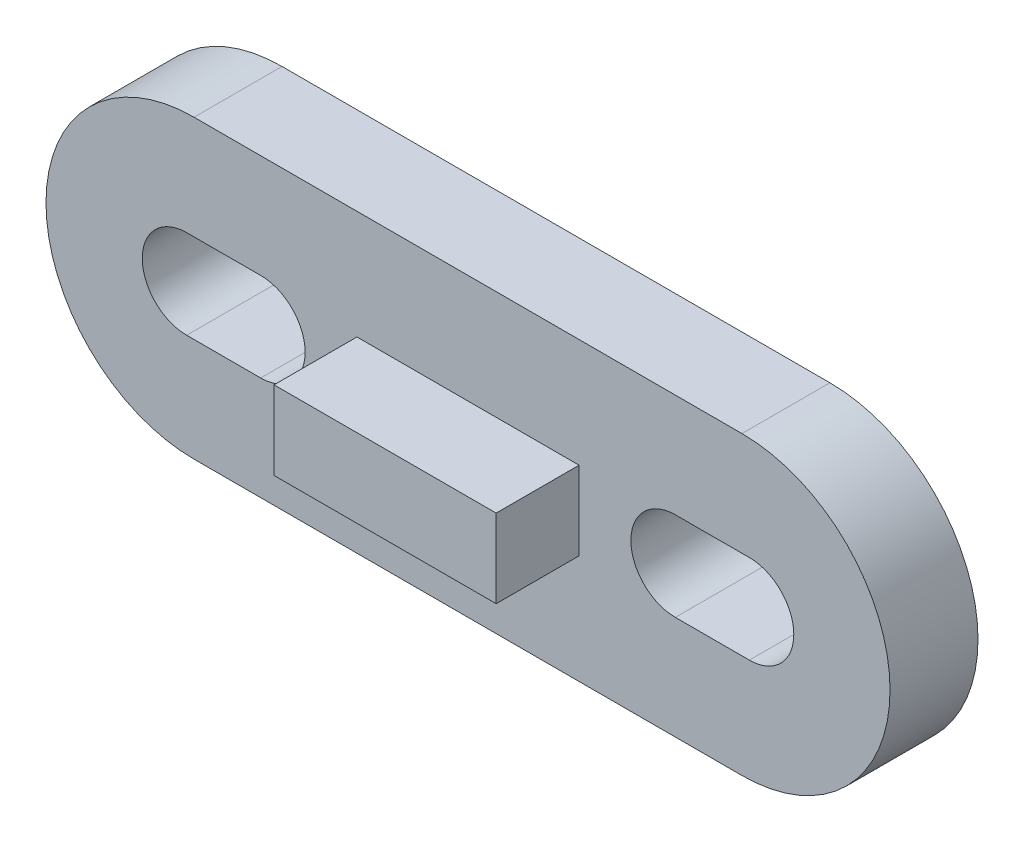
ISO-10303-21;
HEADER;
FILE_DESCRIPTION(('STEP AP214'),'2;1');
FILE_NAME('part.step','',(''),(''),'','','');
FILE_SCHEMA(('AUTOMOTIVE_DESIGN { 1 0 10303 214 1 1 1 1 }'));
ENDSEC;
DATA;
#1=APPLICATION_CONTEXT('core data for automotive mechanical design processes');
#2=APPLICATION_PROTOCOL_DEFINITION('international standard','automotive_design',2000,#1);
#3=PRODUCT_CONTEXT('',#1,'mechanical');
#4=PRODUCT('Part','Part','',(#3));
#5=PRODUCT_RELATED_PRODUCT_CATEGORY('part','',(#4));
#6=PRODUCT_DEFINITION_FORMATION('','',#4);
#7=PRODUCT_DEFINITION_CONTEXT('part definition',#1,'design');
#8=PRODUCT_DEFINITION('design','',#6,#7);
#9=PRODUCT_DEFINITION_SHAPE('','',#8);
#10=(LENGTH_UNIT() NAMED_UNIT(*) SI_UNIT(.MILLI.,.METRE.));
#11=(NAMED_UNIT(*) PLANE_ANGLE_UNIT() SI_UNIT($,.RADIAN.));
#12=(NAMED_UNIT(*) SI_UNIT($,.STERADIAN.) SOLID_ANGLE_UNIT());
#13=UNCERTAINTY_MEASURE_WITH_UNIT(LENGTH_MEASURE(1.E-05),#10,'distance_accuracy_value','');
#14=(GEOMETRIC_REPRESENTATION_CONTEXT(3) GLOBAL_UNCERTAINTY_ASSIGNED_CONTEXT((#13)) GLOBAL_UNIT_ASSIGNED_CONTEXT((#10,
#11,#12)) REPRESENTATION_CONTEXT('',''));
#15=CARTESIAN_POINT('',(0.,0.,0.));
#16=DIRECTION('',(0.,0.,1.));
#17=DIRECTION('',(1.,0.,0.));
#18=AXIS2_PLACEMENT_3D('',#15,#16,#17);
#19=CARTESIAN_POINT('',(-9.25,0.,2.97));
#20=DIRECTION('',(0.,0.,1.));
#21=DIRECTION('',(1.,0.,0.));
#22=AXIS2_PLACEMENT_3D('',#19,#20,#21);
#23=PLANE('',#22);
#24=CARTESIAN_POINT('',(-9.25,0.,2.97));
#25=DIRECTION('',(0.,0.,1.));
#26=DIRECTION('',(1.,0.,0.));
#27=AXIS2_PLACEMENT_3D('',#24,#25,#26);
#28=CIRCLE('',#27,5.00000000000001);
#29=CARTESIAN_POINT('',(-9.25,5.00000000000001,2.97));
#30=VERTEX_POINT('',#29);
#31=CARTESIAN_POINT('',(-9.25,-5.00000000000001,2.97));
#32=VERTEX_POINT('',#31);
#33=EDGE_CURVE('E271',#30,#32,#28,.T.);
#34=ORIENTED_EDGE('',*,*,#33,.T.);
#35=DIRECTION('',(1.,0.,0.));
#36=VECTOR('',#35,1.);
#37=CARTESIAN_POINT('',(-9.25,-5.00000000000001,2.97));
#38=LINE('',#37,#36);
#39=CARTESIAN_POINT('',(9.25,-5.,2.97));
#40=VERTEX_POINT('',#39);
#41=EDGE_CURVE('E275',#32,#40,#38,.T.);
#42=ORIENTED_EDGE('',*,*,#41,.T.);
#43=CARTESIAN_POINT('',(9.25,0.,2.97));
#44=DIRECTION('',(0.,0.,1.));
#45=DIRECTION('',(1.,0.,0.));
#46=AXIS2_PLACEMENT_3D('',#43,#44,#45);
#47=CIRCLE('',#46,5.00000000000001);
#48=CARTESIAN_POINT('',(9.25,5.00000000000001,2.97));
#49=VERTEX_POINT('',#48);
#50=EDGE_CURVE('E279',#40,#49,#47,.T.);
#51=ORIENTED_EDGE('',*,*,#50,.T.);
#52=DIRECTION('',(-1.,0.,0.));
#53=VECTOR('',#52,1.);
#54=CARTESIAN_POINT('',(-9.25,5.00000000000001,2.97));
#55=LINE('',#54,#53);
#56=EDGE_CURVE('E282',#49,#30,#55,.T.);
#57=ORIENTED_EDGE('',*,*,#56,.T.);
#58=EDGE_LOOP('',(#34,#42,#51,#57));
#59=FACE_BOUND('',#58,.T.);
#60=DIRECTION('',(1.,0.,0.));
#61=VECTOR('',#60,1.);
#62=CARTESIAN_POINT('',(-9.5,-1.5,2.97));
#63=LINE('',#62,#61);
#64=CARTESIAN_POINT('',(-9.5,-1.5,2.97));
#65=VERTEX_POINT('',#64);
#66=CARTESIAN_POINT('',(-7.,-1.5,2.97));
#67=VERTEX_POINT('',#66);
#68=EDGE_CURVE('E231',#65,#67,#63,.T.);
#69=ORIENTED_EDGE('',*,*,#68,.F.);
#70=CARTESIAN_POINT('',(-9.5,0.,2.97));
#71=DIRECTION('',(0.,0.,1.));
#72=DIRECTION('',(1.,0.,0.));
#73=AXIS2_PLACEMENT_3D('',#70,#71,#72);
#74=CIRCLE('',#73,1.5);
#75=CARTESIAN_POINT('',(-9.5,1.5,2.97));
#76=VERTEX_POINT('',#75);
#77=EDGE_CURVE('E228',#76,#65,#74,.T.);
#78=ORIENTED_EDGE('',*,*,#77,.F.);
#79=DIRECTION('',(-1.,0.,0.));
#80=VECTOR('',#79,1.);
#81=CARTESIAN_POINT('',(-9.5,1.5,2.97));
#82=LINE('',#81,#80);
#83=CARTESIAN_POINT('',(-7.,1.5,2.97));
#84=VERTEX_POINT('',#83);
#85=EDGE_CURVE('E239',#84,#76,#82,.T.);
#86=ORIENTED_EDGE('',*,*,#85,.F.);
#87=CARTESIAN_POINT('',(-7.,0.,2.97));
#88=DIRECTION('',(0.,0.,1.));
#89=DIRECTION('',(1.,0.,0.));
#90=AXIS2_PLACEMENT_3D('',#87,#88,#89);
#91=CIRCLE('',#90,1.5);
#92=EDGE_CURVE('E235',#67,#84,#91,.T.);
#93=ORIENTED_EDGE('',*,*,#92,.F.);
#94=EDGE_LOOP('',(#69,#78,#86,#93));
#95=FACE_BOUND('',#94,.T.);
#96=DIRECTION('',(-1.,0.,0.));
#97=VECTOR('',#96,1.);
#98=CARTESIAN_POINT('',(9.5,1.5,2.97));
#99=LINE('',#98,#97);
#100=CARTESIAN_POINT('',(9.5,1.5,2.97));
#101=VERTEX_POINT('',#100);
#102=CARTESIAN_POINT('',(7.,1.5,2.97));
#103=VERTEX_POINT('',#102);
#104=EDGE_CURVE('E194',#101,#103,#99,.T.);
#105=ORIENTED_EDGE('',*,*,#104,.F.);
#106=CARTESIAN_POINT('',(9.5,0.,2.97));
#107=DIRECTION('',(0.,0.,1.));
#108=DIRECTION('',(1.,0.,0.));
#109=AXIS2_PLACEMENT_3D('',#106,#107,#108);
#110=CIRCLE('',#109,1.5);
#111=CARTESIAN_POINT('',(9.5,-1.5,2.97));
#112=VERTEX_POINT('',#111);
#113=EDGE_CURVE('E191',#112,#101,#110,.T.);
#114=ORIENTED_EDGE('',*,*,#113,.F.);
#115=DIRECTION('',(1.,0.,0.));
#116=VECTOR('',#115,1.);
#117=CARTESIAN_POINT('',(9.5,-1.5,2.97));
#118=LINE('',#117,#116);
#119=CARTESIAN_POINT('',(7.,-1.5,2.97));
#120=VERTEX_POINT('',#119);
#121=EDGE_CURVE('E201',#120,#112,#118,.T.);
#122=ORIENTED_EDGE('',*,*,#121,.F.);
#123=CARTESIAN_POINT('',(7.,0.,2.97));
#124=DIRECTION('',(0.,0.,1.));
#125=DIRECTION('',(1.,0.,0.));
#126=AXIS2_PLACEMENT_3D('',#123,#124,#125);
#127=CIRCLE('',#126,1.5);
#128=EDGE_CURVE('E198',#103,#120,#127,.T.);
#129=ORIENTED_EDGE('',*,*,#128,.F.);
#130=EDGE_LOOP('',(#105,#114,#122,#129));
#131=FACE_BOUND('',#130,.T.);
#132=DIRECTION('',(-1.,0.,0.));
#133=VECTOR('',#132,1.);
#134=CARTESIAN_POINT('',(-3.75,1.325,2.97));
#135=LINE('',#134,#133);
#136=CARTESIAN_POINT('',(3.75,1.325,2.97));
#137=VERTEX_POINT('',#136);
#138=CARTESIAN_POINT('',(-3.75,1.325,2.97));
#139=VERTEX_POINT('',#138);
#140=EDGE_CURVE('E373',#137,#139,#135,.T.);
#141=ORIENTED_EDGE('',*,*,#140,.F.);
#142=DIRECTION('',(0.,1.,0.));
#143=VECTOR('',#142,1.);
#144=CARTESIAN_POINT('',(3.75,1.325,2.97));
#145=LINE('',#144,#143);
#146=CARTESIAN_POINT('',(3.75,-1.325,2.97));
#147=VERTEX_POINT('',#146);
#148=EDGE_CURVE('E178',#147,#137,#145,.T.);
#149=ORIENTED_EDGE('',*,*,#148,.F.);
#150=DIRECTION('',(1.,0.,0.));
#151=VECTOR('',#150,1.);
#152=CARTESIAN_POINT('',(-3.75,-1.325,2.97));
#153=LINE('',#152,#151);
#154=CARTESIAN_POINT('',(-3.75,-1.325,2.97));
#155=VERTEX_POINT('',#154);
#156=EDGE_CURVE('E174',#155,#147,#153,.T.);
#157=ORIENTED_EDGE('',*,*,#156,.F.);
#158=DIRECTION('',(0.,-1.,0.));
#159=VECTOR('',#158,1.);
#160=CARTESIAN_POINT('',(-3.75,1.325,2.97));
#161=LINE('',#160,#159);
#162=EDGE_CURVE('E375',#139,#155,#161,.T.);
#163=ORIENTED_EDGE('',*,*,#162,.F.);
#164=EDGE_LOOP('',(#141,#149,#157,#163));
#165=FACE_BOUND('',#164,.T.);
#166=ADVANCED_FACE('F39',(#59,#95,#131,#165),#23,.T.);
#167=CARTESIAN_POINT('',(-9.25,0.,0.));
#168=DIRECTION('',(0.,0.,1.));
#169=DIRECTION('',(1.,0.,0.));
#170=AXIS2_PLACEMENT_3D('',#167,#168,#169);
#171=PLANE('',#170);
#172=CARTESIAN_POINT('',(-9.5,0.,0.));
#173=DIRECTION('',(0.,0.,1.));
#174=DIRECTION('',(1.,0.,0.));
#175=AXIS2_PLACEMENT_3D('',#172,#173,#174);
#176=CIRCLE('',#175,1.5);
#177=CARTESIAN_POINT('',(-9.5,1.5,0.));
#178=VERTEX_POINT('',#177);
#179=CARTESIAN_POINT('',(-9.5,-1.5,0.));
#180=VERTEX_POINT('',#179);
#181=EDGE_CURVE('E227',#178,#180,#176,.T.);
#182=ORIENTED_EDGE('',*,*,#181,.T.);
#183=DIRECTION('',(1.,0.,0.));
#184=VECTOR('',#183,1.);
#185=CARTESIAN_POINT('',(-9.5,-1.5,0.));
#186=LINE('',#185,#184);
#187=CARTESIAN_POINT('',(-7.,-1.5,0.));
#188=VERTEX_POINT('',#187);
#189=EDGE_CURVE('E246',#180,#188,#186,.T.);
#190=ORIENTED_EDGE('',*,*,#189,.T.);
#191=CARTESIAN_POINT('',(-7.,0.,0.));
#192=DIRECTION('',(0.,0.,1.));
#193=DIRECTION('',(1.,0.,0.));
#194=AXIS2_PLACEMENT_3D('',#191,#192,#193);
#195=CIRCLE('',#194,1.5);
#196=CARTESIAN_POINT('',(-7.,1.5,0.));
#197=VERTEX_POINT('',#196);
#198=EDGE_CURVE('E250',#188,#197,#195,.T.);
#199=ORIENTED_EDGE('',*,*,#198,.T.);
#200=DIRECTION('',(-1.,0.,0.));
#201=VECTOR('',#200,1.);
#202=CARTESIAN_POINT('',(-9.5,1.5,0.));
#203=LINE('',#202,#201);
#204=EDGE_CURVE('E232',#197,#178,#203,.T.);
#205=ORIENTED_EDGE('',*,*,#204,.T.);
#206=EDGE_LOOP('',(#182,#190,#199,#205));
#207=FACE_BOUND('',#206,.T.);
#208=CARTESIAN_POINT('',(-9.25,0.,0.));
#209=DIRECTION('',(0.,0.,1.));
#210=DIRECTION('',(1.,0.,0.));
#211=AXIS2_PLACEMENT_3D('',#208,#209,#210);
#212=CIRCLE('',#211,5.00000000000001);
#213=CARTESIAN_POINT('',(-9.25,5.00000000000001,0.));
#214=VERTEX_POINT('',#213);
#215=CARTESIAN_POINT('',(-9.25,-5.00000000000001,0.));
#216=VERTEX_POINT('',#215);
#217=EDGE_CURVE('E270',#214,#216,#212,.T.);
#218=ORIENTED_EDGE('',*,*,#217,.F.);
#219=DIRECTION('',(-1.,0.,0.));
#220=VECTOR('',#219,1.);
#221=CARTESIAN_POINT('',(-9.25,5.00000000000001,0.));
#222=LINE('',#221,#220);
#223=CARTESIAN_POINT('',(9.25,5.00000000000001,0.));
#224=VERTEX_POINT('',#223);
#225=EDGE_CURVE('E276',#224,#214,#222,.T.);
#226=ORIENTED_EDGE('',*,*,#225,.F.);
#227=CARTESIAN_POINT('',(9.25,0.,0.));
#228=DIRECTION('',(0.,0.,1.));
#229=DIRECTION('',(1.,0.,0.));
#230=AXIS2_PLACEMENT_3D('',#227,#228,#229);
#231=CIRCLE('',#230,5.00000000000001);
#232=CARTESIAN_POINT('',(9.25,-5.,0.));
#233=VERTEX_POINT('',#232);
#234=EDGE_CURVE('E292',#233,#224,#231,.T.);
#235=ORIENTED_EDGE('',*,*,#234,.F.);
#236=DIRECTION('',(1.,0.,0.));
#237=VECTOR('',#236,1.);
#238=CARTESIAN_POINT('',(-9.25,-5.00000000000001,0.));
#239=LINE('',#238,#237);
#240=EDGE_CURVE('E289',#216,#233,#239,.T.);
#241=ORIENTED_EDGE('',*,*,#240,.F.);
#242=EDGE_LOOP('',(#218,#226,#235,#241));
#243=FACE_BOUND('',#242,.T.);
#244=CARTESIAN_POINT('',(9.5,0.,0.));
#245=DIRECTION('',(0.,0.,1.));
#246=DIRECTION('',(1.,0.,0.));
#247=AXIS2_PLACEMENT_3D('',#244,#245,#246);
#248=CIRCLE('',#247,1.5);
#249=CARTESIAN_POINT('',(9.5,-1.5,0.));
#250=VERTEX_POINT('',#249);
#251=CARTESIAN_POINT('',(9.5,1.5,0.));
#252=VERTEX_POINT('',#251);
#253=EDGE_CURVE('E181',#250,#252,#248,.T.);
#254=ORIENTED_EDGE('',*,*,#253,.T.);
#255=DIRECTION('',(-1.,0.,0.));
#256=VECTOR('',#255,1.);
#257=CARTESIAN_POINT('',(9.5,1.5,0.));
#258=LINE('',#257,#256);
#259=CARTESIAN_POINT('',(7.,1.5,0.));
#260=VERTEX_POINT('',#259);
#261=EDGE_CURVE('E186',#252,#260,#258,.T.);
#262=ORIENTED_EDGE('',*,*,#261,.T.);
#263=CARTESIAN_POINT('',(7.,0.,0.));
#264=DIRECTION('',(0.,0.,1.));
#265=DIRECTION('',(1.,0.,0.));
#266=AXIS2_PLACEMENT_3D('',#263,#264,#265);
#267=CIRCLE('',#266,1.5);
#268=CARTESIAN_POINT('',(7.,-1.5,0.));
#269=VERTEX_POINT('',#268);
#270=EDGE_CURVE('E208',#260,#269,#267,.T.);
#271=ORIENTED_EDGE('',*,*,#270,.T.);
#272=DIRECTION('',(1.,0.,0.));
#273=VECTOR('',#272,1.);
#274=CARTESIAN_POINT('',(9.5,-1.5,0.));
#275=LINE('',#274,#273);
#276=EDGE_CURVE('E195',#269,#250,#275,.T.);
#277=ORIENTED_EDGE('',*,*,#276,.T.);
#278=EDGE_LOOP('',(#254,#262,#271,#277));
#279=FACE_BOUND('',#278,.T.);
#280=ADVANCED_FACE('F315',(#207,#243,#279),#171,.F.);
#281=CARTESIAN_POINT('',(-9.25,0.,2.97));
#282=DIRECTION('',(0.,0.,-1.));
#283=DIRECTION('',(-1.,0.,0.));
#284=AXIS2_PLACEMENT_3D('',#281,#282,#283);
#285=CYLINDRICAL_SURFACE('',#284,5.00000000000001);
#286=ORIENTED_EDGE('',*,*,#217,.T.);
#287=DIRECTION('',(0.,0.,-1.));
#288=VECTOR('',#287,1.);
#289=CARTESIAN_POINT('',(-9.25,-5.00000000000001,2.97));
#290=LINE('',#289,#288);
#291=EDGE_CURVE('E11',#32,#216,#290,.T.);
#292=ORIENTED_EDGE('',*,*,#291,.F.);
#293=ORIENTED_EDGE('',*,*,#33,.F.);
#294=DIRECTION('',(0.,0.,-1.));
#295=VECTOR('',#294,1.);
#296=CARTESIAN_POINT('',(-9.25,5.00000000000001,2.97));
#297=LINE('',#296,#295);
#298=EDGE_CURVE('E285',#30,#214,#297,.T.);
#299=ORIENTED_EDGE('',*,*,#298,.T.);
#300=EDGE_LOOP('',(#286,#292,#293,#299));
#301=FACE_BOUND('',#300,.T.);
#302=ADVANCED_FACE('F41',(#301),#285,.T.);
#303=CARTESIAN_POINT('',(-9.25,-5.00000000000001,2.97));
#304=DIRECTION('',(0.,1.,0.));
#305=DIRECTION('',(0.,0.,1.));
#306=AXIS2_PLACEMENT_3D('',#303,#304,#305);
#307=PLANE('',#306);
#308=ORIENTED_EDGE('',*,*,#240,.T.);
#309=DIRECTION('',(0.,0.,-1.));
#310=VECTOR('',#309,1.);
#311=CARTESIAN_POINT('',(9.25,-5.,2.97));
#312=LINE('',#311,#310);
#313=EDGE_CURVE('E48',#40,#233,#312,.T.);
#314=ORIENTED_EDGE('',*,*,#313,.F.);
#315=ORIENTED_EDGE('',*,*,#41,.F.);
#316=ORIENTED_EDGE('',*,*,#291,.T.);
#317=EDGE_LOOP('',(#308,#314,#315,#316));
#318=FACE_BOUND('',#317,.T.);
#319=ADVANCED_FACE('F326',(#318),#307,.F.);
#320=CARTESIAN_POINT('',(9.25,0.,2.97));
#321=DIRECTION('',(0.,0.,-1.));
#322=DIRECTION('',(-1.,0.,0.));
#323=AXIS2_PLACEMENT_3D('',#320,#321,#322);
#324=CYLINDRICAL_SURFACE('',#323,5.00000000000001);
#325=ORIENTED_EDGE('',*,*,#234,.T.);
#326=DIRECTION('',(0.,0.,-1.));
#327=VECTOR('',#326,1.);
#328=CARTESIAN_POINT('',(9.25,5.00000000000001,2.97));
#329=LINE('',#328,#327);
#330=EDGE_CURVE('E300',#49,#224,#329,.T.);
#331=ORIENTED_EDGE('',*,*,#330,.F.);
#332=ORIENTED_EDGE('',*,*,#50,.F.);
#333=ORIENTED_EDGE('',*,*,#313,.T.);
#334=EDGE_LOOP('',(#325,#331,#332,#333));
#335=FACE_BOUND('',#334,.T.);
#336=ADVANCED_FACE('F309',(#335),#324,.T.);
#337=CARTESIAN_POINT('',(-9.25,5.00000000000001,2.97));
#338=DIRECTION('',(0.,-1.,0.));
#339=DIRECTION('',(1.,0.,0.));
#340=AXIS2_PLACEMENT_3D('',#337,#338,#339);
#341=PLANE('',#340);
#342=ORIENTED_EDGE('',*,*,#225,.T.);
#343=ORIENTED_EDGE('',*,*,#298,.F.);
#344=ORIENTED_EDGE('',*,*,#56,.F.);
#345=ORIENTED_EDGE('',*,*,#330,.T.);
#346=EDGE_LOOP('',(#342,#343,#344,#345));
#347=FACE_BOUND('',#346,.T.);
#348=ADVANCED_FACE('F319',(#347),#341,.F.);
#349=CARTESIAN_POINT('',(-9.5,0.,2.97));
#350=DIRECTION('',(0.,0.,-1.));
#351=DIRECTION('',(-1.,0.,0.));
#352=AXIS2_PLACEMENT_3D('',#349,#350,#351);
#353=CYLINDRICAL_SURFACE('',#352,1.5);
#354=ORIENTED_EDGE('',*,*,#181,.F.);
#355=DIRECTION('',(0.,0.,-1.));
#356=VECTOR('',#355,1.);
#357=CARTESIAN_POINT('',(-9.5,1.5,2.97));
#358=LINE('',#357,#356);
#359=EDGE_CURVE('E242',#76,#178,#358,.T.);
#360=ORIENTED_EDGE('',*,*,#359,.F.);
#361=ORIENTED_EDGE('',*,*,#77,.T.);
#362=DIRECTION('',(0.,0.,-1.));
#363=VECTOR('',#362,1.);
#364=CARTESIAN_POINT('',(-9.5,-1.5,2.97));
#365=LINE('',#364,#363);
#366=EDGE_CURVE('E266',#65,#180,#365,.T.);
#367=ORIENTED_EDGE('',*,*,#366,.T.);
#368=EDGE_LOOP('',(#354,#360,#361,#367));
#369=FACE_BOUND('',#368,.T.);
#370=ADVANCED_FACE('F341',(#369),#353,.F.);
#371=CARTESIAN_POINT('',(-9.5,-1.5,2.97));
#372=DIRECTION('',(0.,1.,0.));
#373=DIRECTION('',(-1.,0.,0.));
#374=AXIS2_PLACEMENT_3D('',#371,#372,#373);
#375=PLANE('',#374);
#376=ORIENTED_EDGE('',*,*,#189,.F.);
#377=ORIENTED_EDGE('',*,*,#366,.F.);
#378=ORIENTED_EDGE('',*,*,#68,.T.);
#379=DIRECTION('',(0.,0.,-1.));
#380=VECTOR('',#379,1.);
#381=CARTESIAN_POINT('',(-7.,-1.5,2.97));
#382=LINE('',#381,#380);
#383=EDGE_CURVE('E263',#67,#188,#382,.T.);
#384=ORIENTED_EDGE('',*,*,#383,.T.);
#385=EDGE_LOOP('',(#376,#377,#378,#384));
#386=FACE_BOUND('',#385,.T.);
#387=ADVANCED_FACE('F348',(#386),#375,.T.);
#388=CARTESIAN_POINT('',(-7.,0.,2.97));
#389=DIRECTION('',(0.,0.,-1.));
#390=DIRECTION('',(-1.,0.,0.));
#391=AXIS2_PLACEMENT_3D('',#388,#389,#390);
#392=CYLINDRICAL_SURFACE('',#391,1.5);
#393=ORIENTED_EDGE('',*,*,#198,.F.);
#394=ORIENTED_EDGE('',*,*,#383,.F.);
#395=ORIENTED_EDGE('',*,*,#92,.T.);
#396=DIRECTION('',(0.,0.,-1.));
#397=VECTOR('',#396,1.);
#398=CARTESIAN_POINT('',(-7.,1.5,2.97));
#399=LINE('',#398,#397);
#400=EDGE_CURVE('E260',#84,#197,#399,.T.);
#401=ORIENTED_EDGE('',*,*,#400,.T.);
#402=EDGE_LOOP('',(#393,#394,#395,#401));
#403=FACE_BOUND('',#402,.T.);
#404=ADVANCED_FACE('F353',(#403),#392,.F.);
#405=CARTESIAN_POINT('',(-9.5,1.5,2.97));
#406=DIRECTION('',(0.,-1.,0.));
#407=DIRECTION('',(1.,0.,0.));
#408=AXIS2_PLACEMENT_3D('',#405,#406,#407);
#409=PLANE('',#408);
#410=ORIENTED_EDGE('',*,*,#204,.F.);
#411=ORIENTED_EDGE('',*,*,#400,.F.);
#412=ORIENTED_EDGE('',*,*,#85,.T.);
#413=ORIENTED_EDGE('',*,*,#359,.T.);
#414=EDGE_LOOP('',(#410,#411,#412,#413));
#415=FACE_BOUND('',#414,.T.);
#416=ADVANCED_FACE('F360',(#415),#409,.T.);
#417=CARTESIAN_POINT('',(9.5,0.,2.97));
#418=DIRECTION('',(0.,0.,-1.));
#419=DIRECTION('',(-1.,0.,0.));
#420=AXIS2_PLACEMENT_3D('',#417,#418,#419);
#421=CYLINDRICAL_SURFACE('',#420,1.5);
#422=ORIENTED_EDGE('',*,*,#253,.F.);
#423=DIRECTION('',(0.,0.,-1.));
#424=VECTOR('',#423,1.);
#425=CARTESIAN_POINT('',(9.5,-1.5,2.97));
#426=LINE('',#425,#424);
#427=EDGE_CURVE('E203',#112,#250,#426,.T.);
#428=ORIENTED_EDGE('',*,*,#427,.F.);
#429=ORIENTED_EDGE('',*,*,#113,.T.);
#430=DIRECTION('',(0.,0.,-1.));
#431=VECTOR('',#430,1.);
#432=CARTESIAN_POINT('',(9.5,1.5,2.97));
#433=LINE('',#432,#431);
#434=EDGE_CURVE('E223',#101,#252,#433,.T.);
#435=ORIENTED_EDGE('',*,*,#434,.T.);
#436=EDGE_LOOP('',(#422,#428,#429,#435));
#437=FACE_BOUND('',#436,.T.);
#438=ADVANCED_FACE('F418',(#437),#421,.F.);
#439=CARTESIAN_POINT('',(9.5,1.5,2.97));
#440=DIRECTION('',(0.,-1.,0.));
#441=DIRECTION('',(0.,0.,-1.));
#442=AXIS2_PLACEMENT_3D('',#439,#440,#441);
#443=PLANE('',#442);
#444=ORIENTED_EDGE('',*,*,#261,.F.);
#445=ORIENTED_EDGE('',*,*,#434,.F.);
#446=ORIENTED_EDGE('',*,*,#104,.T.);
#447=DIRECTION('',(0.,0.,-1.));
#448=VECTOR('',#447,1.);
#449=CARTESIAN_POINT('',(7.,1.5,2.97));
#450=LINE('',#449,#448);
#451=EDGE_CURVE('E220',#103,#260,#450,.T.);
#452=ORIENTED_EDGE('',*,*,#451,.T.);
#453=EDGE_LOOP('',(#444,#445,#446,#452));
#454=FACE_BOUND('',#453,.T.);
#455=ADVANCED_FACE('F414',(#454),#443,.T.);
#456=CARTESIAN_POINT('',(7.,0.,2.97));
#457=DIRECTION('',(0.,0.,-1.));
#458=DIRECTION('',(-1.,0.,0.));
#459=AXIS2_PLACEMENT_3D('',#456,#457,#458);
#460=CYLINDRICAL_SURFACE('',#459,1.5);
#461=ORIENTED_EDGE('',*,*,#270,.F.);
#462=ORIENTED_EDGE('',*,*,#451,.F.);
#463=ORIENTED_EDGE('',*,*,#128,.T.);
#464=DIRECTION('',(0.,0.,-1.));
#465=VECTOR('',#464,1.);
#466=CARTESIAN_POINT('',(7.,-1.5,2.97));
#467=LINE('',#466,#465);
#468=EDGE_CURVE('E63',#120,#269,#467,.T.);
#469=ORIENTED_EDGE('',*,*,#468,.T.);
#470=EDGE_LOOP('',(#461,#462,#463,#469));
#471=FACE_BOUND('',#470,.T.);
#472=ADVANCED_FACE('F411',(#471),#460,.F.);
#473=CARTESIAN_POINT('',(9.5,-1.5,2.97));
#474=DIRECTION('',(0.,1.,0.));
#475=DIRECTION('',(-1.,0.,0.));
#476=AXIS2_PLACEMENT_3D('',#473,#474,#475);
#477=PLANE('',#476);
#478=ORIENTED_EDGE('',*,*,#276,.F.);
#479=ORIENTED_EDGE('',*,*,#468,.F.);
#480=ORIENTED_EDGE('',*,*,#121,.T.);
#481=ORIENTED_EDGE('',*,*,#427,.T.);
#482=EDGE_LOOP('',(#478,#479,#480,#481));
#483=FACE_BOUND('',#482,.T.);
#484=ADVANCED_FACE('F408',(#483),#477,.T.);
#485=CARTESIAN_POINT('',(3.75,1.325,5.77));
#486=DIRECTION('',(-1.,0.,0.));
#487=DIRECTION('',(0.,-1.,0.));
#488=AXIS2_PLACEMENT_3D('',#485,#486,#487);
#489=PLANE('',#488);
#490=ORIENTED_EDGE('',*,*,#148,.T.);
#491=DIRECTION('',(0.,0.,-1.));
#492=VECTOR('',#491,1.);
#493=CARTESIAN_POINT('',(3.75,1.325,5.77));
#494=LINE('',#493,#492);
#495=CARTESIAN_POINT('',(3.75,1.325,5.77));
#496=VERTEX_POINT('',#495);
#497=EDGE_CURVE('E157',#496,#137,#494,.T.);
#498=ORIENTED_EDGE('',*,*,#497,.F.);
#499=DIRECTION('',(0.,1.,0.));
#500=VECTOR('',#499,1.);
#501=CARTESIAN_POINT('',(3.75,1.325,5.77));
#502=LINE('',#501,#500);
#503=CARTESIAN_POINT('',(3.75,-1.325,5.77));
#504=VERTEX_POINT('',#503);
#505=EDGE_CURVE('E165',#504,#496,#502,.T.);
#506=ORIENTED_EDGE('',*,*,#505,.F.);
#507=DIRECTION('',(0.,0.,-1.));
#508=VECTOR('',#507,1.);
#509=CARTESIAN_POINT('',(3.75,-1.325,5.77));
#510=LINE('',#509,#508);
#511=EDGE_CURVE('E386',#504,#147,#510,.T.);
#512=ORIENTED_EDGE('',*,*,#511,.T.);
#513=EDGE_LOOP('',(#490,#498,#506,#512));
#514=FACE_BOUND('',#513,.T.);
#515=ADVANCED_FACE('F176',(#514),#489,.F.);
#516=CARTESIAN_POINT('',(-3.75,1.325,5.77));
#517=DIRECTION('',(0.,-1.,0.));
#518=DIRECTION('',(0.,0.,-1.));
#519=AXIS2_PLACEMENT_3D('',#516,#517,#518);
#520=PLANE('',#519);
#521=ORIENTED_EDGE('',*,*,#140,.T.);
#522=DIRECTION('',(0.,0.,-1.));
#523=VECTOR('',#522,1.);
#524=CARTESIAN_POINT('',(-3.75,1.325,5.77));
#525=LINE('',#524,#523);
#526=CARTESIAN_POINT('',(-3.75,1.325,5.77));
#527=VERTEX_POINT('',#526);
#528=EDGE_CURVE('E160',#527,#139,#525,.T.);
#529=ORIENTED_EDGE('',*,*,#528,.F.);
#530=DIRECTION('',(-1.,0.,0.));
#531=VECTOR('',#530,1.);
#532=CARTESIAN_POINT('',(-3.75,1.325,5.77));
#533=LINE('',#532,#531);
#534=EDGE_CURVE('E153',#496,#527,#533,.T.);
#535=ORIENTED_EDGE('',*,*,#534,.F.);
#536=ORIENTED_EDGE('',*,*,#497,.T.);
#537=EDGE_LOOP('',(#521,#529,#535,#536));
#538=FACE_BOUND('',#537,.T.);
#539=ADVANCED_FACE('F155',(#538),#520,.F.);
#540=CARTESIAN_POINT('',(-3.75,1.325,5.77));
#541=DIRECTION('',(1.,0.,0.));
#542=DIRECTION('',(0.,1.,0.));
#543=AXIS2_PLACEMENT_3D('',#540,#541,#542);
#544=PLANE('',#543);
#545=ORIENTED_EDGE('',*,*,#162,.T.);
#546=DIRECTION('',(0.,0.,-1.));
#547=VECTOR('',#546,1.);
#548=CARTESIAN_POINT('',(-3.75,-1.325,5.77));
#549=LINE('',#548,#547);
#550=CARTESIAN_POINT('',(-3.75,-1.325,5.77));
#551=VERTEX_POINT('',#550);
#552=EDGE_CURVE('E55',#551,#155,#549,.T.);
#553=ORIENTED_EDGE('',*,*,#552,.F.);
#554=DIRECTION('',(0.,-1.,0.));
#555=VECTOR('',#554,1.);
#556=CARTESIAN_POINT('',(-3.75,1.325,5.77));
#557=LINE('',#556,#555);
#558=EDGE_CURVE('E164',#527,#551,#557,.T.);
#559=ORIENTED_EDGE('',*,*,#558,.F.);
#560=ORIENTED_EDGE('',*,*,#528,.T.);
#561=EDGE_LOOP('',(#545,#553,#559,#560));
#562=FACE_BOUND('',#561,.T.);
#563=ADVANCED_FACE('F393',(#562),#544,.F.);
#564=CARTESIAN_POINT('',(-3.75,-1.325,5.77));
#565=DIRECTION('',(0.,1.,0.));
#566=DIRECTION('',(0.,0.,1.));
#567=AXIS2_PLACEMENT_3D('',#564,#565,#566);
#568=PLANE('',#567);
#569=ORIENTED_EDGE('',*,*,#156,.T.);
#570=ORIENTED_EDGE('',*,*,#511,.F.);
#571=DIRECTION('',(1.,0.,0.));
#572=VECTOR('',#571,1.);
#573=CARTESIAN_POINT('',(-3.75,-1.325,5.77));
#574=LINE('',#573,#572);
#575=EDGE_CURVE('E169',#551,#504,#574,.T.);
#576=ORIENTED_EDGE('',*,*,#575,.F.);
#577=ORIENTED_EDGE('',*,*,#552,.T.);
#578=EDGE_LOOP('',(#569,#570,#576,#577));
#579=FACE_BOUND('',#578,.T.);
#580=ADVANCED_FACE('F394',(#579),#568,.F.);
#581=CARTESIAN_POINT('',(0.,0.,5.77));
#582=DIRECTION('',(0.,0.,1.));
#583=DIRECTION('',(1.,0.,0.));
#584=AXIS2_PLACEMENT_3D('',#581,#582,#583);
#585=PLANE('',#584);
#586=ORIENTED_EDGE('',*,*,#505,.T.);
#587=ORIENTED_EDGE('',*,*,#534,.T.);
#588=ORIENTED_EDGE('',*,*,#558,.T.);
#589=ORIENTED_EDGE('',*,*,#575,.T.);
#590=EDGE_LOOP('',(#586,#587,#588,#589));
#591=FACE_BOUND('',#590,.T.);
#592=ADVANCED_FACE('F168',(#591),#585,.T.);
#593=CLOSED_SHELL('',(#166,#280,#302,#319,#336,#348,#370,#387,#404,#416,#438,#455,#472,#484,
#515,#539,#563,#580,#592));
#594=MANIFOLD_SOLID_BREP('B2',#593);
#595=ADVANCED_BREP_SHAPE_REPRESENTATION('',(#18,#594),#14);
#596=SHAPE_DEFINITION_REPRESENTATION(#9,#595);
ENDSEC;
END-ISO-10303-21;
